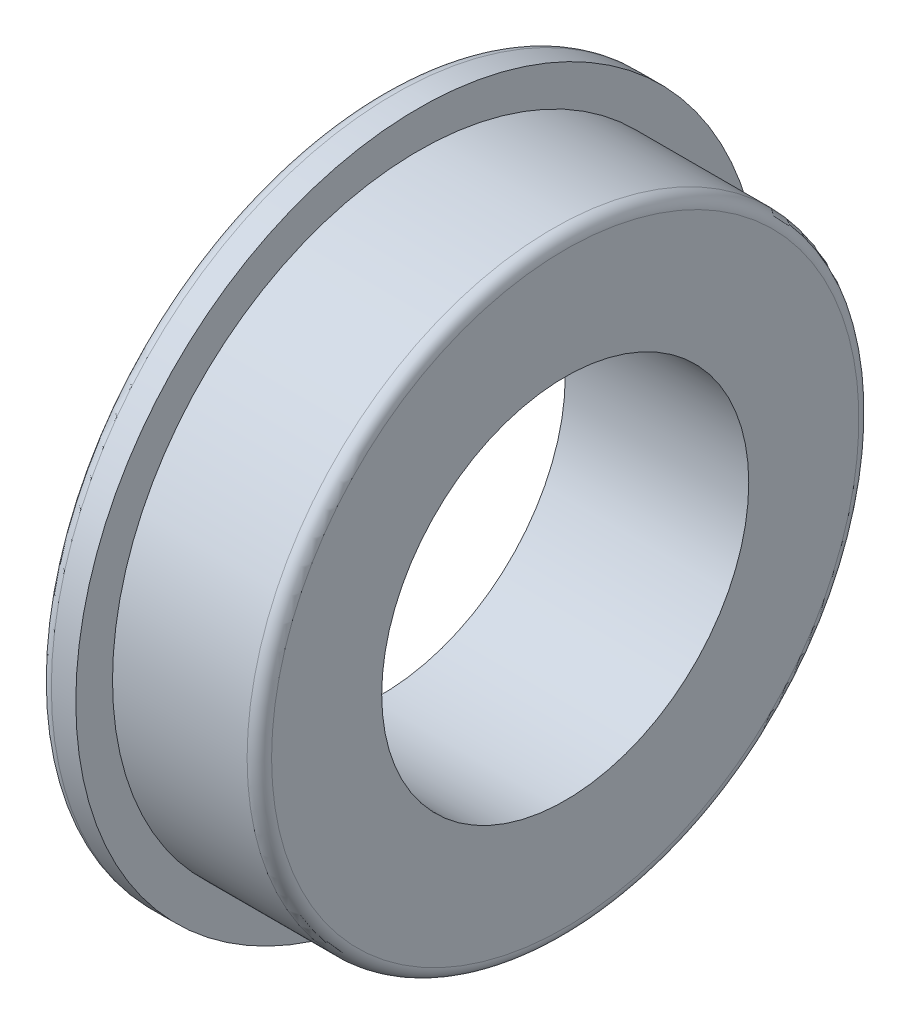
ISO-10303-21;
HEADER;
FILE_DESCRIPTION(('STEP AP214'),'2;1');
FILE_NAME('part.step','',(''),(''),'','','');
FILE_SCHEMA(('AUTOMOTIVE_DESIGN { 1 0 10303 214 1 1 1 1 }'));
ENDSEC;
DATA;
#1=APPLICATION_CONTEXT('core data for automotive mechanical design processes');
#2=APPLICATION_PROTOCOL_DEFINITION('international standard','automotive_design',2000,#1);
#3=PRODUCT_CONTEXT('',#1,'mechanical');
#4=PRODUCT('Part','Part','',(#3));
#5=PRODUCT_RELATED_PRODUCT_CATEGORY('part','',(#4));
#6=PRODUCT_DEFINITION_FORMATION('','',#4);
#7=PRODUCT_DEFINITION_CONTEXT('part definition',#1,'design');
#8=PRODUCT_DEFINITION('design','',#6,#7);
#9=PRODUCT_DEFINITION_SHAPE('','',#8);
#10=(LENGTH_UNIT() NAMED_UNIT(*) SI_UNIT(.MILLI.,.METRE.));
#11=(NAMED_UNIT(*) PLANE_ANGLE_UNIT() SI_UNIT($,.RADIAN.));
#12=(NAMED_UNIT(*) SI_UNIT($,.STERADIAN.) SOLID_ANGLE_UNIT());
#13=UNCERTAINTY_MEASURE_WITH_UNIT(LENGTH_MEASURE(1.E-05),#10,'distance_accuracy_value','');
#14=(GEOMETRIC_REPRESENTATION_CONTEXT(3) GLOBAL_UNCERTAINTY_ASSIGNED_CONTEXT((#13)) GLOBAL_UNIT_ASSIGNED_CONTEXT((#10,
#11,#12)) REPRESENTATION_CONTEXT('',''));
#15=CARTESIAN_POINT('',(0.,0.,0.));
#16=DIRECTION('',(0.,0.,1.));
#17=DIRECTION('',(1.,0.,0.));
#18=AXIS2_PLACEMENT_3D('',#15,#16,#17);
#19=CARTESIAN_POINT('',(0.,0.,0.));
#20=DIRECTION('',(-1.,0.,0.));
#21=DIRECTION('',(0.,0.,1.));
#22=AXIS2_PLACEMENT_3D('',#19,#20,#21);
#23=CYLINDRICAL_SURFACE('',#22,3.);
#24=CARTESIAN_POINT('',(3.,0.,0.));
#25=DIRECTION('',(-1.,0.,0.));
#26=DIRECTION('',(0.,0.,1.));
#27=AXIS2_PLACEMENT_3D('',#24,#25,#26);
#28=CIRCLE('',#27,3.);
#29=CARTESIAN_POINT('',(3.,0.,3.));
#30=VERTEX_POINT('',#29);
#31=EDGE_CURVE('E62',#30,#30,#28,.T.);
#32=ORIENTED_EDGE('',*,*,#31,.F.);
#33=EDGE_LOOP('',(#32));
#34=FACE_BOUND('',#33,.T.);
#35=CARTESIAN_POINT('',(0.,0.,0.));
#36=DIRECTION('',(-1.,0.,0.));
#37=DIRECTION('',(0.,0.,1.));
#38=AXIS2_PLACEMENT_3D('',#35,#36,#37);
#39=CIRCLE('',#38,3.);
#40=CARTESIAN_POINT('',(0.,0.,3.));
#41=VERTEX_POINT('',#40);
#42=EDGE_CURVE('E53',#41,#41,#39,.T.);
#43=ORIENTED_EDGE('',*,*,#42,.T.);
#44=EDGE_LOOP('',(#43));
#45=FACE_BOUND('',#44,.T.);
#46=ADVANCED_FACE('F33',(#34,#45),#23,.F.);
#47=CARTESIAN_POINT('',(0.,3.,0.));
#48=DIRECTION('',(1.,0.,0.));
#49=DIRECTION('',(0.,0.,-1.));
#50=AXIS2_PLACEMENT_3D('',#47,#48,#49);
#51=PLANE('',#50);
#52=CARTESIAN_POINT('',(0.,0.,0.));
#53=DIRECTION('',(1.,0.,0.));
#54=DIRECTION('',(0.,0.,-1.));
#55=AXIS2_PLACEMENT_3D('',#52,#53,#54);
#56=CIRCLE('',#55,5.4);
#57=CARTESIAN_POINT('',(0.,0.,-5.4));
#58=VERTEX_POINT('',#57);
#59=EDGE_CURVE('E48',#58,#58,#56,.F.);
#60=ORIENTED_EDGE('',*,*,#59,.T.);
#61=EDGE_LOOP('',(#60));
#62=FACE_BOUND('',#61,.T.);
#63=ORIENTED_EDGE('',*,*,#42,.F.);
#64=EDGE_LOOP('',(#63));
#65=FACE_BOUND('',#64,.T.);
#66=ADVANCED_FACE('F70',(#62,#65),#51,.F.);
#67=CARTESIAN_POINT('',(0.,0.,0.));
#68=DIRECTION('',(-1.,0.,0.));
#69=DIRECTION('',(0.,0.,1.));
#70=AXIS2_PLACEMENT_3D('',#67,#68,#69);
#71=CYLINDRICAL_SURFACE('',#70,5.6);
#72=CARTESIAN_POINT('',(0.2,0.,0.));
#73=DIRECTION('',(1.,0.,0.));
#74=DIRECTION('',(0.,0.,-1.));
#75=AXIS2_PLACEMENT_3D('',#72,#73,#74);
#76=CIRCLE('',#75,5.6);
#77=CARTESIAN_POINT('',(0.2,0.,-5.6));
#78=VERTEX_POINT('',#77);
#79=EDGE_CURVE('E44',#78,#78,#76,.T.);
#80=ORIENTED_EDGE('',*,*,#79,.T.);
#81=EDGE_LOOP('',(#80));
#82=FACE_BOUND('',#81,.T.);
#83=CARTESIAN_POINT('',(0.6,0.,0.));
#84=DIRECTION('',(-1.,0.,0.));
#85=DIRECTION('',(0.,0.,1.));
#86=AXIS2_PLACEMENT_3D('',#83,#84,#85);
#87=CIRCLE('',#86,5.6);
#88=CARTESIAN_POINT('',(0.6,0.,5.6));
#89=VERTEX_POINT('',#88);
#90=EDGE_CURVE('E56',#89,#89,#87,.T.);
#91=ORIENTED_EDGE('',*,*,#90,.T.);
#92=EDGE_LOOP('',(#91));
#93=FACE_BOUND('',#92,.T.);
#94=ADVANCED_FACE('F75',(#82,#93),#71,.T.);
#95=CARTESIAN_POINT('',(0.6,5.6,0.));
#96=DIRECTION('',(-1.,0.,0.));
#97=DIRECTION('',(0.,0.,1.));
#98=AXIS2_PLACEMENT_3D('',#95,#96,#97);
#99=PLANE('',#98);
#100=ORIENTED_EDGE('',*,*,#90,.F.);
#101=EDGE_LOOP('',(#100));
#102=FACE_BOUND('',#101,.T.);
#103=CARTESIAN_POINT('',(0.6,0.,0.));
#104=DIRECTION('',(-1.,0.,0.));
#105=DIRECTION('',(0.,0.,1.));
#106=AXIS2_PLACEMENT_3D('',#103,#104,#105);
#107=CIRCLE('',#106,5.);
#108=CARTESIAN_POINT('',(0.6,0.,5.));
#109=VERTEX_POINT('',#108);
#110=EDGE_CURVE('E59',#109,#109,#107,.T.);
#111=ORIENTED_EDGE('',*,*,#110,.T.);
#112=EDGE_LOOP('',(#111));
#113=FACE_BOUND('',#112,.T.);
#114=ADVANCED_FACE('F81',(#102,#113),#99,.F.);
#115=CARTESIAN_POINT('',(0.,0.,0.));
#116=DIRECTION('',(-1.,0.,0.));
#117=DIRECTION('',(0.,0.,1.));
#118=AXIS2_PLACEMENT_3D('',#115,#116,#117);
#119=CYLINDRICAL_SURFACE('',#118,5.);
#120=CARTESIAN_POINT('',(2.8,0.,0.));
#121=DIRECTION('',(-1.,0.,0.));
#122=DIRECTION('',(0.,0.,1.));
#123=AXIS2_PLACEMENT_3D('',#120,#121,#122);
#124=CIRCLE('',#123,5.);
#125=CARTESIAN_POINT('',(2.8,0.,5.));
#126=VERTEX_POINT('',#125);
#127=EDGE_CURVE('E40',#126,#126,#124,.T.);
#128=ORIENTED_EDGE('',*,*,#127,.T.);
#129=EDGE_LOOP('',(#128));
#130=FACE_BOUND('',#129,.T.);
#131=ORIENTED_EDGE('',*,*,#110,.F.);
#132=EDGE_LOOP('',(#131));
#133=FACE_BOUND('',#132,.T.);
#134=ADVANCED_FACE('F93',(#130,#133),#119,.T.);
#135=CARTESIAN_POINT('',(3.,5.,0.));
#136=DIRECTION('',(-1.,0.,0.));
#137=DIRECTION('',(0.,0.,1.));
#138=AXIS2_PLACEMENT_3D('',#135,#136,#137);
#139=PLANE('',#138);
#140=CARTESIAN_POINT('',(3.,0.,0.));
#141=DIRECTION('',(-1.,0.,0.));
#142=DIRECTION('',(0.,0.,1.));
#143=AXIS2_PLACEMENT_3D('',#140,#141,#142);
#144=CIRCLE('',#143,4.8);
#145=CARTESIAN_POINT('',(3.,0.,4.8));
#146=VERTEX_POINT('',#145);
#147=EDGE_CURVE('E10',#146,#146,#144,.F.);
#148=ORIENTED_EDGE('',*,*,#147,.T.);
#149=EDGE_LOOP('',(#148));
#150=FACE_BOUND('',#149,.T.);
#151=ORIENTED_EDGE('',*,*,#31,.T.);
#152=EDGE_LOOP('',(#151));
#153=FACE_BOUND('',#152,.T.);
#154=ADVANCED_FACE('F66',(#150,#153),#139,.F.);
#155=CARTESIAN_POINT('',(0.2,0.,0.));
#156=DIRECTION('',(1.,0.,0.));
#157=DIRECTION('',(0.,0.,-1.));
#158=AXIS2_PLACEMENT_3D('',#155,#156,#157);
#159=TOROIDAL_SURFACE('',#158,5.4,0.2);
#160=ORIENTED_EDGE('',*,*,#79,.F.);
#161=EDGE_LOOP('',(#160));
#162=FACE_BOUND('',#161,.T.);
#163=ORIENTED_EDGE('',*,*,#59,.F.);
#164=EDGE_LOOP('',(#163));
#165=FACE_BOUND('',#164,.T.);
#166=ADVANCED_FACE('F85',(#162,#165),#159,.T.);
#167=CARTESIAN_POINT('',(2.8,0.,0.));
#168=DIRECTION('',(-1.,0.,0.));
#169=DIRECTION('',(0.,0.,1.));
#170=AXIS2_PLACEMENT_3D('',#167,#168,#169);
#171=TOROIDAL_SURFACE('',#170,4.8,0.2);
#172=ORIENTED_EDGE('',*,*,#147,.F.);
#173=EDGE_LOOP('',(#172));
#174=FACE_BOUND('',#173,.T.);
#175=ORIENTED_EDGE('',*,*,#127,.F.);
#176=EDGE_LOOP('',(#175));
#177=FACE_BOUND('',#176,.T.);
#178=ADVANCED_FACE('F35',(#174,#177),#171,.T.);
#179=CLOSED_SHELL('',(#46,#66,#94,#114,#134,#154,#166,#178));
#180=MANIFOLD_SOLID_BREP('B2',#179);
#181=ADVANCED_BREP_SHAPE_REPRESENTATION('',(#18,#180),#14);
#182=SHAPE_DEFINITION_REPRESENTATION(#9,#181);
ENDSEC;
END-ISO-10303-21;
